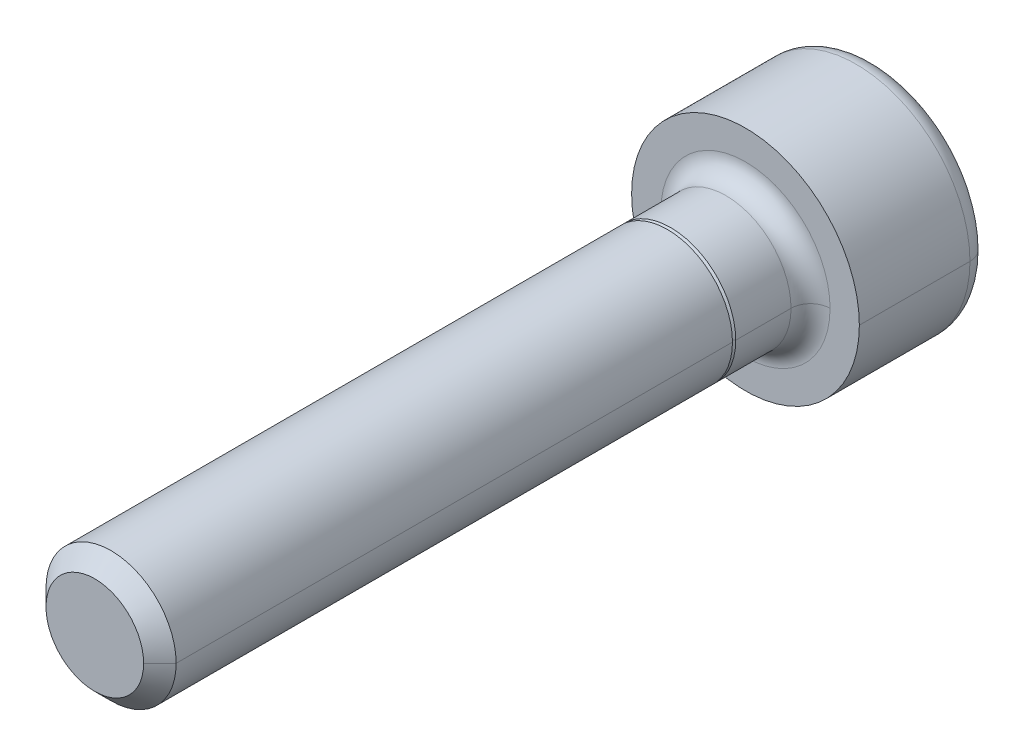
ISO-10303-21;
HEADER;
FILE_DESCRIPTION(('STEP AP214'),'2;1');
FILE_NAME('part.step','',(''),(''),'','','');
FILE_SCHEMA(('AUTOMOTIVE_DESIGN { 1 0 10303 214 1 1 1 1 }'));
ENDSEC;
DATA;
#1=APPLICATION_CONTEXT('core data for automotive mechanical design processes');
#2=APPLICATION_PROTOCOL_DEFINITION('international standard','automotive_design',2000,#1);
#3=PRODUCT_CONTEXT('',#1,'mechanical');
#4=PRODUCT('Part','Part','',(#3));
#5=PRODUCT_RELATED_PRODUCT_CATEGORY('part','',(#4));
#6=PRODUCT_DEFINITION_FORMATION('','',#4);
#7=PRODUCT_DEFINITION_CONTEXT('part definition',#1,'design');
#8=PRODUCT_DEFINITION('design','',#6,#7);
#9=PRODUCT_DEFINITION_SHAPE('','',#8);
#10=(LENGTH_UNIT() NAMED_UNIT(*) SI_UNIT(.MILLI.,.METRE.));
#11=(NAMED_UNIT(*) PLANE_ANGLE_UNIT() SI_UNIT($,.RADIAN.));
#12=(NAMED_UNIT(*) SI_UNIT($,.STERADIAN.) SOLID_ANGLE_UNIT());
#13=UNCERTAINTY_MEASURE_WITH_UNIT(LENGTH_MEASURE(1.E-05),#10,'distance_accuracy_value','');
#14=(GEOMETRIC_REPRESENTATION_CONTEXT(3) GLOBAL_UNCERTAINTY_ASSIGNED_CONTEXT((#13)) GLOBAL_UNIT_ASSIGNED_CONTEXT((#10,
#11,#12)) REPRESENTATION_CONTEXT('',''));
#15=CARTESIAN_POINT('',(0.,0.,0.));
#16=DIRECTION('',(0.,0.,1.));
#17=DIRECTION('',(1.,0.,0.));
#18=AXIS2_PLACEMENT_3D('',#15,#16,#17);
#19=CARTESIAN_POINT('',(0.,0.,-3.4));
#20=DIRECTION('',(0.,0.,1.));
#21=DIRECTION('',(1.,0.,0.));
#22=AXIS2_PLACEMENT_3D('',#19,#20,#21);
#23=TOROIDAL_SURFACE('',#22,2.9,0.6);
#24=CARTESIAN_POINT('',(-2.9,0.,-3.4));
#25=DIRECTION('',(0.,1.,0.));
#26=DIRECTION('',(-1.,0.,0.));
#27=AXIS2_PLACEMENT_3D('',#24,#25,#26);
#28=CIRCLE('',#27,0.6);
#29=CARTESIAN_POINT('',(-2.9,0.,-4.));
#30=VERTEX_POINT('',#29);
#31=CARTESIAN_POINT('',(-3.5,0.,-3.4));
#32=VERTEX_POINT('',#31);
#33=EDGE_CURVE('E348',#30,#32,#28,.T.);
#34=ORIENTED_EDGE('',*,*,#33,.F.);
#35=CARTESIAN_POINT('',(0.,0.,-4.));
#36=DIRECTION('',(0.,0.,-1.));
#37=DIRECTION('',(1.,0.,0.));
#38=AXIS2_PLACEMENT_3D('',#35,#36,#37);
#39=CIRCLE('',#38,2.9);
#40=CARTESIAN_POINT('',(2.9,0.,-4.));
#41=VERTEX_POINT('',#40);
#42=EDGE_CURVE('E243',#41,#30,#39,.T.);
#43=ORIENTED_EDGE('',*,*,#42,.F.);
#44=CARTESIAN_POINT('',(2.9,0.,-3.4));
#45=DIRECTION('',(0.,-1.,0.));
#46=DIRECTION('',(0.,0.,-1.));
#47=AXIS2_PLACEMENT_3D('',#44,#45,#46);
#48=CIRCLE('',#47,0.6);
#49=CARTESIAN_POINT('',(3.5,0.,-3.4));
#50=VERTEX_POINT('',#49);
#51=EDGE_CURVE('E355',#41,#50,#48,.T.);
#52=ORIENTED_EDGE('',*,*,#51,.T.);
#53=CARTESIAN_POINT('',(0.,0.,-3.4));
#54=DIRECTION('',(0.,0.,1.));
#55=DIRECTION('',(1.,0.,0.));
#56=AXIS2_PLACEMENT_3D('',#53,#54,#55);
#57=CIRCLE('',#56,3.5);
#58=EDGE_CURVE('E237',#32,#50,#57,.T.);
#59=ORIENTED_EDGE('',*,*,#58,.F.);
#60=EDGE_LOOP('',(#34,#43,#52,#59));
#61=FACE_BOUND('',#60,.T.);
#62=ADVANCED_FACE('F17',(#61),#23,.T.);
#63=CARTESIAN_POINT('',(0.,0.,0.6));
#64=DIRECTION('',(0.,0.,1.));
#65=DIRECTION('',(1.,0.,0.));
#66=AXIS2_PLACEMENT_3D('',#63,#64,#65);
#67=TOROIDAL_SURFACE('',#66,2.6,0.6);
#68=CARTESIAN_POINT('',(-2.6,0.,0.6));
#69=DIRECTION('',(0.,1.,0.));
#70=DIRECTION('',(-1.,0.,0.));
#71=AXIS2_PLACEMENT_3D('',#68,#69,#70);
#72=CIRCLE('',#71,0.6);
#73=CARTESIAN_POINT('',(-2.,0.,0.6));
#74=VERTEX_POINT('',#73);
#75=CARTESIAN_POINT('',(-2.6,0.,0.));
#76=VERTEX_POINT('',#75);
#77=EDGE_CURVE('E311',#74,#76,#72,.T.);
#78=ORIENTED_EDGE('',*,*,#77,.F.);
#79=CARTESIAN_POINT('',(0.,0.,0.6));
#80=DIRECTION('',(0.,0.,1.));
#81=DIRECTION('',(1.,0.,0.));
#82=AXIS2_PLACEMENT_3D('',#79,#80,#81);
#83=CIRCLE('',#82,2.);
#84=CARTESIAN_POINT('',(2.,0.,0.6));
#85=VERTEX_POINT('',#84);
#86=EDGE_CURVE('E218',#85,#74,#83,.T.);
#87=ORIENTED_EDGE('',*,*,#86,.F.);
#88=CARTESIAN_POINT('',(2.6,0.,0.6));
#89=DIRECTION('',(0.,-1.,0.));
#90=DIRECTION('',(0.,0.,-1.));
#91=AXIS2_PLACEMENT_3D('',#88,#89,#90);
#92=CIRCLE('',#91,0.6);
#93=CARTESIAN_POINT('',(2.6,0.,0.));
#94=VERTEX_POINT('',#93);
#95=EDGE_CURVE('E318',#85,#94,#92,.T.);
#96=ORIENTED_EDGE('',*,*,#95,.T.);
#97=CARTESIAN_POINT('',(0.,0.,0.));
#98=DIRECTION('',(0.,0.,-1.));
#99=DIRECTION('',(1.,0.,0.));
#100=AXIS2_PLACEMENT_3D('',#97,#98,#99);
#101=CIRCLE('',#100,2.6);
#102=EDGE_CURVE('E277',#76,#94,#101,.T.);
#103=ORIENTED_EDGE('',*,*,#102,.F.);
#104=EDGE_LOOP('',(#78,#87,#96,#103));
#105=FACE_BOUND('',#104,.T.);
#106=ADVANCED_FACE('F384',(#105),#67,.F.);
#107=CARTESIAN_POINT('',(0.,0.,20.));
#108=DIRECTION('',(0.,0.,-1.));
#109=DIRECTION('',(-1.,0.,0.));
#110=AXIS2_PLACEMENT_3D('',#107,#108,#109);
#111=CONICAL_SURFACE('',#110,1.5,0.785398163397443);
#112=DIRECTION('',(0.707106781186544,0.,-0.707106781186551));
#113=VECTOR('',#112,1.);
#114=CARTESIAN_POINT('',(1.5,0.,20.));
#115=LINE('',#114,#113);
#116=CARTESIAN_POINT('',(1.5,0.,20.));
#117=VERTEX_POINT('',#116);
#118=CARTESIAN_POINT('',(2.,0.,19.5));
#119=VERTEX_POINT('',#118);
#120=EDGE_CURVE('E337',#117,#119,#115,.T.);
#121=ORIENTED_EDGE('',*,*,#120,.F.);
#122=CARTESIAN_POINT('',(0.,0.,20.));
#123=DIRECTION('',(0.,0.,1.));
#124=DIRECTION('',(1.,0.,0.));
#125=AXIS2_PLACEMENT_3D('',#122,#123,#124);
#126=CIRCLE('',#125,1.5);
#127=CARTESIAN_POINT('',(-1.5,0.,20.));
#128=VERTEX_POINT('',#127);
#129=EDGE_CURVE('E11',#128,#117,#126,.T.);
#130=ORIENTED_EDGE('',*,*,#129,.F.);
#131=DIRECTION('',(-0.707106781186544,0.,-0.707106781186551));
#132=VECTOR('',#131,1.);
#133=CARTESIAN_POINT('',(-1.5,0.,20.));
#134=LINE('',#133,#132);
#135=CARTESIAN_POINT('',(-2.,0.,19.5));
#136=VERTEX_POINT('',#135);
#137=EDGE_CURVE('E323',#128,#136,#134,.T.);
#138=ORIENTED_EDGE('',*,*,#137,.T.);
#139=CARTESIAN_POINT('',(0.,0.,19.5));
#140=DIRECTION('',(0.,0.,-1.));
#141=DIRECTION('',(1.,0.,0.));
#142=AXIS2_PLACEMENT_3D('',#139,#140,#141);
#143=CIRCLE('',#142,2.);
#144=EDGE_CURVE('E180',#119,#136,#143,.T.);
#145=ORIENTED_EDGE('',*,*,#144,.F.);
#146=EDGE_LOOP('',(#121,#130,#138,#145));
#147=FACE_BOUND('',#146,.T.);
#148=ADVANCED_FACE('F864',(#147),#111,.T.);
#149=CARTESIAN_POINT('',(0.,0.,2.4));
#150=DIRECTION('',(0.,0.,1.));
#151=DIRECTION('',(1.,0.,0.));
#152=AXIS2_PLACEMENT_3D('',#149,#150,#151);
#153=PLANE('',#152);
#154=CARTESIAN_POINT('',(0.,0.,2.4));
#155=DIRECTION('',(0.,0.,1.));
#156=DIRECTION('',(1.,0.,0.));
#157=AXIS2_PLACEMENT_3D('',#154,#155,#156);
#158=CIRCLE('',#157,1.9);
#159=CARTESIAN_POINT('',(-1.9,0.,2.4));
#160=VERTEX_POINT('',#159);
#161=CARTESIAN_POINT('',(1.9,0.,2.4));
#162=VERTEX_POINT('',#161);
#163=EDGE_CURVE('E169',#160,#162,#158,.T.);
#164=ORIENTED_EDGE('',*,*,#163,.T.);
#165=CARTESIAN_POINT('',(0.,0.,2.4));
#166=DIRECTION('',(0.,0.,1.));
#167=DIRECTION('',(1.,0.,0.));
#168=AXIS2_PLACEMENT_3D('',#165,#166,#167);
#169=CIRCLE('',#168,1.9);
#170=EDGE_CURVE('E185',#162,#160,#169,.T.);
#171=ORIENTED_EDGE('',*,*,#170,.T.);
#172=EDGE_LOOP('',(#164,#171));
#173=FACE_BOUND('',#172,.T.);
#174=CARTESIAN_POINT('',(0.,0.,2.4));
#175=DIRECTION('',(0.,0.,1.));
#176=DIRECTION('',(1.,0.,0.));
#177=AXIS2_PLACEMENT_3D('',#174,#175,#176);
#178=CIRCLE('',#177,2.);
#179=CARTESIAN_POINT('',(-2.,0.,2.4));
#180=VERTEX_POINT('',#179);
#181=CARTESIAN_POINT('',(2.,0.,2.4));
#182=VERTEX_POINT('',#181);
#183=EDGE_CURVE('E25',#180,#182,#178,.T.);
#184=ORIENTED_EDGE('',*,*,#183,.F.);
#185=CARTESIAN_POINT('',(0.,0.,2.4));
#186=DIRECTION('',(0.,0.,1.));
#187=DIRECTION('',(1.,0.,0.));
#188=AXIS2_PLACEMENT_3D('',#185,#186,#187);
#189=CIRCLE('',#188,2.);
#190=EDGE_CURVE('E203',#182,#180,#189,.T.);
#191=ORIENTED_EDGE('',*,*,#190,.F.);
#192=EDGE_LOOP('',(#184,#191));
#193=FACE_BOUND('',#192,.T.);
#194=ADVANCED_FACE('F191',(#173,#193),#153,.F.);
#195=CARTESIAN_POINT('',(0.,0.,20.));
#196=DIRECTION('',(0.,0.,1.));
#197=DIRECTION('',(1.,0.,0.));
#198=AXIS2_PLACEMENT_3D('',#195,#196,#197);
#199=PLANE('',#198);
#200=ORIENTED_EDGE('',*,*,#129,.T.);
#201=CARTESIAN_POINT('',(0.,0.,20.));
#202=DIRECTION('',(0.,0.,1.));
#203=DIRECTION('',(1.,0.,0.));
#204=AXIS2_PLACEMENT_3D('',#201,#202,#203);
#205=CIRCLE('',#204,1.5);
#206=EDGE_CURVE('E321',#117,#128,#205,.T.);
#207=ORIENTED_EDGE('',*,*,#206,.T.);
#208=EDGE_LOOP('',(#200,#207));
#209=FACE_BOUND('',#208,.T.);
#210=ADVANCED_FACE('F844',(#209),#199,.T.);
#211=CARTESIAN_POINT('',(0.,0.,20.));
#212=DIRECTION('',(0.,0.,-1.));
#213=DIRECTION('',(-1.,0.,0.));
#214=AXIS2_PLACEMENT_3D('',#211,#212,#213);
#215=CYLINDRICAL_SURFACE('',#214,2.);
#216=DIRECTION('',(0.,0.,-1.));
#217=VECTOR('',#216,1.);
#218=CARTESIAN_POINT('',(2.,0.,20.));
#219=LINE('',#218,#217);
#220=EDGE_CURVE('E326',#119,#182,#219,.T.);
#221=ORIENTED_EDGE('',*,*,#220,.F.);
#222=ORIENTED_EDGE('',*,*,#144,.T.);
#223=DIRECTION('',(0.,0.,-1.));
#224=VECTOR('',#223,1.);
#225=CARTESIAN_POINT('',(-2.,0.,20.));
#226=LINE('',#225,#224);
#227=EDGE_CURVE('E194',#136,#180,#226,.T.);
#228=ORIENTED_EDGE('',*,*,#227,.T.);
#229=ORIENTED_EDGE('',*,*,#183,.T.);
#230=EDGE_LOOP('',(#221,#222,#228,#229));
#231=FACE_BOUND('',#230,.T.);
#232=ADVANCED_FACE('F834',(#231),#215,.T.);
#233=CARTESIAN_POINT('',(0.,0.,2.4));
#234=DIRECTION('',(0.,0.,-1.));
#235=DIRECTION('',(-1.,0.,0.));
#236=AXIS2_PLACEMENT_3D('',#233,#234,#235);
#237=CONICAL_SURFACE('',#236,1.9,0.785398163397448);
#238=DIRECTION('',(0.707106781186548,0.,-0.707106781186548));
#239=VECTOR('',#238,1.);
#240=CARTESIAN_POINT('',(1.9,0.,2.4));
#241=LINE('',#240,#239);
#242=CARTESIAN_POINT('',(2.,0.,2.3));
#243=VERTEX_POINT('',#242);
#244=EDGE_CURVE('E175',#162,#243,#241,.T.);
#245=ORIENTED_EDGE('',*,*,#244,.F.);
#246=ORIENTED_EDGE('',*,*,#163,.F.);
#247=DIRECTION('',(-0.707106781186548,0.,-0.707106781186548));
#248=VECTOR('',#247,1.);
#249=CARTESIAN_POINT('',(-1.9,0.,2.4));
#250=LINE('',#249,#248);
#251=CARTESIAN_POINT('',(-2.,0.,2.3));
#252=VERTEX_POINT('',#251);
#253=EDGE_CURVE('E172',#160,#252,#250,.T.);
#254=ORIENTED_EDGE('',*,*,#253,.T.);
#255=CARTESIAN_POINT('',(0.,0.,2.3));
#256=DIRECTION('',(0.,0.,-1.));
#257=DIRECTION('',(1.,0.,0.));
#258=AXIS2_PLACEMENT_3D('',#255,#256,#257);
#259=CIRCLE('',#258,2.);
#260=EDGE_CURVE('E181',#243,#252,#259,.T.);
#261=ORIENTED_EDGE('',*,*,#260,.F.);
#262=EDGE_LOOP('',(#245,#246,#254,#261));
#263=FACE_BOUND('',#262,.T.);
#264=ADVANCED_FACE('F171',(#263),#237,.T.);
#265=CARTESIAN_POINT('',(0.,0.,2.4));
#266=DIRECTION('',(0.,0.,-1.));
#267=DIRECTION('',(-1.,0.,0.));
#268=AXIS2_PLACEMENT_3D('',#265,#266,#267);
#269=CYLINDRICAL_SURFACE('',#268,2.);
#270=DIRECTION('',(0.,0.,-1.));
#271=VECTOR('',#270,1.);
#272=CARTESIAN_POINT('',(2.,0.,2.4));
#273=LINE('',#272,#271);
#274=EDGE_CURVE('E189',#243,#85,#273,.T.);
#275=ORIENTED_EDGE('',*,*,#274,.F.);
#276=ORIENTED_EDGE('',*,*,#260,.T.);
#277=DIRECTION('',(0.,0.,-1.));
#278=VECTOR('',#277,1.);
#279=CARTESIAN_POINT('',(-2.,0.,2.4));
#280=LINE('',#279,#278);
#281=EDGE_CURVE('E222',#252,#74,#280,.T.);
#282=ORIENTED_EDGE('',*,*,#281,.T.);
#283=CARTESIAN_POINT('',(0.,0.,0.6));
#284=DIRECTION('',(0.,0.,1.));
#285=DIRECTION('',(1.,0.,0.));
#286=AXIS2_PLACEMENT_3D('',#283,#284,#285);
#287=CIRCLE('',#286,2.);
#288=EDGE_CURVE('E363',#74,#85,#287,.T.);
#289=ORIENTED_EDGE('',*,*,#288,.T.);
#290=EDGE_LOOP('',(#275,#276,#282,#289));
#291=FACE_BOUND('',#290,.T.);
#292=ADVANCED_FACE('F815',(#291),#269,.T.);
#293=CARTESIAN_POINT('',(0.,0.,-1.5));
#294=DIRECTION('',(0.,0.,-1.));
#295=DIRECTION('',(0.,-1.,0.));
#296=AXIS2_PLACEMENT_3D('',#293,#294,#295);
#297=PLANE('',#296);
#298=DIRECTION('',(-0.5,-0.866025403784439,0.));
#299=VECTOR('',#298,1.);
#300=CARTESIAN_POINT('',(1.73205080756888,0.,-1.5));
#301=LINE('',#300,#299);
#302=CARTESIAN_POINT('',(1.73205080756888,0.,-1.5));
#303=VERTEX_POINT('',#302);
#304=CARTESIAN_POINT('',(0.866025403784438,-1.5,-1.5));
#305=VERTEX_POINT('',#304);
#306=EDGE_CURVE('E211',#303,#305,#301,.T.);
#307=ORIENTED_EDGE('',*,*,#306,.T.);
#308=DIRECTION('',(-1.,0.,0.));
#309=VECTOR('',#308,1.);
#310=CARTESIAN_POINT('',(0.866025403784438,-1.5,-1.5));
#311=LINE('',#310,#309);
#312=CARTESIAN_POINT('',(-0.866025403784439,-1.5,-1.5));
#313=VERTEX_POINT('',#312);
#314=EDGE_CURVE('E38',#305,#313,#311,.T.);
#315=ORIENTED_EDGE('',*,*,#314,.T.);
#316=DIRECTION('',(-0.5,0.866025403784439,0.));
#317=VECTOR('',#316,1.);
#318=CARTESIAN_POINT('',(-0.866025403784439,-1.5,-1.5));
#319=LINE('',#318,#317);
#320=CARTESIAN_POINT('',(-1.73205080756888,0.,-1.5));
#321=VERTEX_POINT('',#320);
#322=EDGE_CURVE('E46',#313,#321,#319,.T.);
#323=ORIENTED_EDGE('',*,*,#322,.T.);
#324=DIRECTION('',(0.5,0.866025403784439,0.));
#325=VECTOR('',#324,1.);
#326=CARTESIAN_POINT('',(-1.73205080756888,0.,-1.5));
#327=LINE('',#326,#325);
#328=CARTESIAN_POINT('',(-0.866025403784439,1.5,-1.5));
#329=VERTEX_POINT('',#328);
#330=EDGE_CURVE('E289',#321,#329,#327,.T.);
#331=ORIENTED_EDGE('',*,*,#330,.T.);
#332=DIRECTION('',(1.,0.,0.));
#333=VECTOR('',#332,1.);
#334=CARTESIAN_POINT('',(-0.866025403784439,1.5,-1.5));
#335=LINE('',#334,#333);
#336=CARTESIAN_POINT('',(0.86602540378444,1.5,-1.5));
#337=VERTEX_POINT('',#336);
#338=EDGE_CURVE('E269',#329,#337,#335,.T.);
#339=ORIENTED_EDGE('',*,*,#338,.T.);
#340=DIRECTION('',(0.5,-0.866025403784439,0.));
#341=VECTOR('',#340,1.);
#342=CARTESIAN_POINT('',(0.86602540378444,1.5,-1.5));
#343=LINE('',#342,#341);
#344=EDGE_CURVE('E210',#337,#303,#343,.T.);
#345=ORIENTED_EDGE('',*,*,#344,.T.);
#346=EDGE_LOOP('',(#307,#315,#323,#331,#339,#345));
#347=FACE_BOUND('',#346,.T.);
#348=ADVANCED_FACE('F804',(#347),#297,.T.);
#349=CARTESIAN_POINT('',(0.866025403784438,-1.5,-1.5));
#350=DIRECTION('',(0.,-1.,0.));
#351=DIRECTION('',(-1.,0.,0.));
#352=AXIS2_PLACEMENT_3D('',#349,#350,#351);
#353=PLANE('',#352);
#354=DIRECTION('',(-1.,0.,0.));
#355=VECTOR('',#354,1.);
#356=CARTESIAN_POINT('',(0.866025403784438,-1.5,-4.));
#357=LINE('',#356,#355);
#358=CARTESIAN_POINT('',(0.866025403784438,-1.5,-4.));
#359=VERTEX_POINT('',#358);
#360=CARTESIAN_POINT('',(-0.866025403784439,-1.5,-4.));
#361=VERTEX_POINT('',#360);
#362=EDGE_CURVE('E246',#359,#361,#357,.T.);
#363=ORIENTED_EDGE('',*,*,#362,.T.);
#364=DIRECTION('',(0.,0.,-1.));
#365=VECTOR('',#364,1.);
#366=CARTESIAN_POINT('',(-0.866025403784439,-1.5,-1.5));
#367=LINE('',#366,#365);
#368=EDGE_CURVE('E225',#313,#361,#367,.T.);
#369=ORIENTED_EDGE('',*,*,#368,.F.);
#370=ORIENTED_EDGE('',*,*,#314,.F.);
#371=DIRECTION('',(0.,0.,-1.));
#372=VECTOR('',#371,1.);
#373=CARTESIAN_POINT('',(0.866025403784438,-1.5,-1.5));
#374=LINE('',#373,#372);
#375=EDGE_CURVE('E249',#305,#359,#374,.T.);
#376=ORIENTED_EDGE('',*,*,#375,.T.);
#377=EDGE_LOOP('',(#363,#369,#370,#376));
#378=FACE_BOUND('',#377,.T.);
#379=ADVANCED_FACE('F766',(#378),#353,.F.);
#380=CARTESIAN_POINT('',(-0.866025403784439,-1.5,-1.5));
#381=DIRECTION('',(-0.866025403784439,-0.5,0.));
#382=DIRECTION('',(-0.5,0.866025403784439,0.));
#383=AXIS2_PLACEMENT_3D('',#380,#381,#382);
#384=PLANE('',#383);
#385=DIRECTION('',(-0.5,0.866025403784439,0.));
#386=VECTOR('',#385,1.);
#387=CARTESIAN_POINT('',(-0.866025403784439,-1.5,-4.));
#388=LINE('',#387,#386);
#389=CARTESIAN_POINT('',(-1.73205080756888,0.,-4.));
#390=VERTEX_POINT('',#389);
#391=EDGE_CURVE('E273',#361,#390,#388,.T.);
#392=ORIENTED_EDGE('',*,*,#391,.T.);
#393=DIRECTION('',(0.,0.,-1.));
#394=VECTOR('',#393,1.);
#395=CARTESIAN_POINT('',(-1.73205080756888,0.,-1.5));
#396=LINE('',#395,#394);
#397=EDGE_CURVE('E292',#321,#390,#396,.T.);
#398=ORIENTED_EDGE('',*,*,#397,.F.);
#399=ORIENTED_EDGE('',*,*,#322,.F.);
#400=ORIENTED_EDGE('',*,*,#368,.T.);
#401=EDGE_LOOP('',(#392,#398,#399,#400));
#402=FACE_BOUND('',#401,.T.);
#403=ADVANCED_FACE('F700',(#402),#384,.F.);
#404=CARTESIAN_POINT('',(-1.73205080756888,0.,-1.5));
#405=DIRECTION('',(-0.866025403784439,0.5,0.));
#406=DIRECTION('',(0.,0.,1.));
#407=AXIS2_PLACEMENT_3D('',#404,#405,#406);
#408=PLANE('',#407);
#409=DIRECTION('',(0.5,0.866025403784439,0.));
#410=VECTOR('',#409,1.);
#411=CARTESIAN_POINT('',(-1.73205080756888,0.,-4.));
#412=LINE('',#411,#410);
#413=CARTESIAN_POINT('',(-0.866025403784439,1.5,-4.));
#414=VERTEX_POINT('',#413);
#415=EDGE_CURVE('E265',#390,#414,#412,.T.);
#416=ORIENTED_EDGE('',*,*,#415,.T.);
#417=DIRECTION('',(0.,0.,-1.));
#418=VECTOR('',#417,1.);
#419=CARTESIAN_POINT('',(-0.866025403784439,1.5,-1.5));
#420=LINE('',#419,#418);
#421=EDGE_CURVE('E286',#329,#414,#420,.T.);
#422=ORIENTED_EDGE('',*,*,#421,.F.);
#423=ORIENTED_EDGE('',*,*,#330,.F.);
#424=ORIENTED_EDGE('',*,*,#397,.T.);
#425=EDGE_LOOP('',(#416,#422,#423,#424));
#426=FACE_BOUND('',#425,.T.);
#427=ADVANCED_FACE('F658',(#426),#408,.F.);
#428=CARTESIAN_POINT('',(-0.866025403784439,1.5,-1.5));
#429=DIRECTION('',(0.,1.,0.));
#430=DIRECTION('',(1.,0.,0.));
#431=AXIS2_PLACEMENT_3D('',#428,#429,#430);
#432=PLANE('',#431);
#433=DIRECTION('',(1.,0.,0.));
#434=VECTOR('',#433,1.);
#435=CARTESIAN_POINT('',(-0.866025403784439,1.5,-4.));
#436=LINE('',#435,#434);
#437=CARTESIAN_POINT('',(0.86602540378444,1.5,-4.));
#438=VERTEX_POINT('',#437);
#439=EDGE_CURVE('E261',#414,#438,#436,.T.);
#440=ORIENTED_EDGE('',*,*,#439,.T.);
#441=DIRECTION('',(0.,0.,-1.));
#442=VECTOR('',#441,1.);
#443=CARTESIAN_POINT('',(0.86602540378444,1.5,-1.5));
#444=LINE('',#443,#442);
#445=EDGE_CURVE('E266',#337,#438,#444,.T.);
#446=ORIENTED_EDGE('',*,*,#445,.F.);
#447=ORIENTED_EDGE('',*,*,#338,.F.);
#448=ORIENTED_EDGE('',*,*,#421,.T.);
#449=EDGE_LOOP('',(#440,#446,#447,#448));
#450=FACE_BOUND('',#449,.T.);
#451=ADVANCED_FACE('F652',(#450),#432,.F.);
#452=CARTESIAN_POINT('',(0.86602540378444,1.5,-1.5));
#453=DIRECTION('',(0.866025403784439,0.5,0.));
#454=DIRECTION('',(0.,0.,-1.));
#455=AXIS2_PLACEMENT_3D('',#452,#453,#454);
#456=PLANE('',#455);
#457=DIRECTION('',(0.5,-0.866025403784439,0.));
#458=VECTOR('',#457,1.);
#459=CARTESIAN_POINT('',(0.86602540378444,1.5,-4.));
#460=LINE('',#459,#458);
#461=CARTESIAN_POINT('',(1.73205080756888,0.,-4.));
#462=VERTEX_POINT('',#461);
#463=EDGE_CURVE('E256',#438,#462,#460,.T.);
#464=ORIENTED_EDGE('',*,*,#463,.T.);
#465=DIRECTION('',(0.,0.,-1.));
#466=VECTOR('',#465,1.);
#467=CARTESIAN_POINT('',(1.73205080756888,0.,-1.5));
#468=LINE('',#467,#466);
#469=EDGE_CURVE('E208',#303,#462,#468,.T.);
#470=ORIENTED_EDGE('',*,*,#469,.F.);
#471=ORIENTED_EDGE('',*,*,#344,.F.);
#472=ORIENTED_EDGE('',*,*,#445,.T.);
#473=EDGE_LOOP('',(#464,#470,#471,#472));
#474=FACE_BOUND('',#473,.T.);
#475=ADVANCED_FACE('F657',(#474),#456,.F.);
#476=CARTESIAN_POINT('',(1.73205080756888,0.,-1.5));
#477=DIRECTION('',(0.866025403784439,-0.5,0.));
#478=DIRECTION('',(0.,0.,-1.));
#479=AXIS2_PLACEMENT_3D('',#476,#477,#478);
#480=PLANE('',#479);
#481=DIRECTION('',(-0.5,-0.866025403784439,0.));
#482=VECTOR('',#481,1.);
#483=CARTESIAN_POINT('',(1.73205080756888,0.,-4.));
#484=LINE('',#483,#482);
#485=EDGE_CURVE('E253',#462,#359,#484,.T.);
#486=ORIENTED_EDGE('',*,*,#485,.T.);
#487=ORIENTED_EDGE('',*,*,#375,.F.);
#488=ORIENTED_EDGE('',*,*,#306,.F.);
#489=ORIENTED_EDGE('',*,*,#469,.T.);
#490=EDGE_LOOP('',(#486,#487,#488,#489));
#491=FACE_BOUND('',#490,.T.);
#492=ADVANCED_FACE('F390',(#491),#480,.F.);
#493=CARTESIAN_POINT('',(0.,0.,0.));
#494=DIRECTION('',(0.,0.,1.));
#495=DIRECTION('',(1.,0.,0.));
#496=AXIS2_PLACEMENT_3D('',#493,#494,#495);
#497=PLANE('',#496);
#498=CARTESIAN_POINT('',(0.,0.,0.));
#499=DIRECTION('',(0.,0.,-1.));
#500=DIRECTION('',(1.,0.,0.));
#501=AXIS2_PLACEMENT_3D('',#498,#499,#500);
#502=CIRCLE('',#501,2.6);
#503=EDGE_CURVE('E322',#94,#76,#502,.T.);
#504=ORIENTED_EDGE('',*,*,#503,.T.);
#505=ORIENTED_EDGE('',*,*,#102,.T.);
#506=EDGE_LOOP('',(#504,#505));
#507=FACE_BOUND('',#506,.T.);
#508=CARTESIAN_POINT('',(0.,0.,0.));
#509=DIRECTION('',(0.,0.,1.));
#510=DIRECTION('',(1.,0.,0.));
#511=AXIS2_PLACEMENT_3D('',#508,#509,#510);
#512=CIRCLE('',#511,3.5);
#513=CARTESIAN_POINT('',(3.5,0.,0.));
#514=VERTEX_POINT('',#513);
#515=CARTESIAN_POINT('',(-3.5,0.,0.));
#516=VERTEX_POINT('',#515);
#517=EDGE_CURVE('E229',#514,#516,#512,.T.);
#518=ORIENTED_EDGE('',*,*,#517,.T.);
#519=CARTESIAN_POINT('',(0.,0.,0.));
#520=DIRECTION('',(0.,0.,1.));
#521=DIRECTION('',(1.,0.,0.));
#522=AXIS2_PLACEMENT_3D('',#519,#520,#521);
#523=CIRCLE('',#522,3.5);
#524=EDGE_CURVE('E240',#516,#514,#523,.T.);
#525=ORIENTED_EDGE('',*,*,#524,.T.);
#526=EDGE_LOOP('',(#518,#525));
#527=FACE_BOUND('',#526,.T.);
#528=ADVANCED_FACE('F386',(#507,#527),#497,.T.);
#529=CARTESIAN_POINT('',(0.,0.,-4.));
#530=DIRECTION('',(0.,0.,1.));
#531=DIRECTION('',(1.,0.,0.));
#532=AXIS2_PLACEMENT_3D('',#529,#530,#531);
#533=PLANE('',#532);
#534=ORIENTED_EDGE('',*,*,#362,.F.);
#535=ORIENTED_EDGE('',*,*,#485,.F.);
#536=ORIENTED_EDGE('',*,*,#463,.F.);
#537=ORIENTED_EDGE('',*,*,#439,.F.);
#538=ORIENTED_EDGE('',*,*,#415,.F.);
#539=ORIENTED_EDGE('',*,*,#391,.F.);
#540=EDGE_LOOP('',(#534,#535,#536,#537,#538,#539));
#541=FACE_BOUND('',#540,.T.);
#542=ORIENTED_EDGE('',*,*,#42,.T.);
#543=CARTESIAN_POINT('',(0.,0.,-4.));
#544=DIRECTION('',(0.,0.,-1.));
#545=DIRECTION('',(1.,0.,0.));
#546=AXIS2_PLACEMENT_3D('',#543,#544,#545);
#547=CIRCLE('',#546,2.9);
#548=EDGE_CURVE('E347',#30,#41,#547,.T.);
#549=ORIENTED_EDGE('',*,*,#548,.T.);
#550=EDGE_LOOP('',(#542,#549));
#551=FACE_BOUND('',#550,.T.);
#552=ADVANCED_FACE('F389',(#541,#551),#533,.F.);
#553=CARTESIAN_POINT('',(0.,0.,-4.));
#554=DIRECTION('',(0.,0.,1.));
#555=DIRECTION('',(1.,0.,0.));
#556=AXIS2_PLACEMENT_3D('',#553,#554,#555);
#557=CYLINDRICAL_SURFACE('',#556,3.5);
#558=DIRECTION('',(0.,0.,1.));
#559=VECTOR('',#558,1.);
#560=CARTESIAN_POINT('',(-3.5,0.,-4.));
#561=LINE('',#560,#559);
#562=EDGE_CURVE('E228',#32,#516,#561,.T.);
#563=ORIENTED_EDGE('',*,*,#562,.F.);
#564=ORIENTED_EDGE('',*,*,#58,.T.);
#565=DIRECTION('',(0.,0.,1.));
#566=VECTOR('',#565,1.);
#567=CARTESIAN_POINT('',(3.5,0.,-4.));
#568=LINE('',#567,#566);
#569=EDGE_CURVE('E233',#50,#514,#568,.T.);
#570=ORIENTED_EDGE('',*,*,#569,.T.);
#571=ORIENTED_EDGE('',*,*,#524,.F.);
#572=EDGE_LOOP('',(#563,#564,#570,#571));
#573=FACE_BOUND('',#572,.T.);
#574=ADVANCED_FACE('F399',(#573),#557,.T.);
#575=CARTESIAN_POINT('',(0.,0.,-4.));
#576=DIRECTION('',(0.,0.,1.));
#577=DIRECTION('',(1.,0.,0.));
#578=AXIS2_PLACEMENT_3D('',#575,#576,#577);
#579=CYLINDRICAL_SURFACE('',#578,3.5);
#580=CARTESIAN_POINT('',(0.,0.,-3.4));
#581=DIRECTION('',(0.,0.,1.));
#582=DIRECTION('',(1.,0.,0.));
#583=AXIS2_PLACEMENT_3D('',#580,#581,#582);
#584=CIRCLE('',#583,3.5);
#585=EDGE_CURVE('E352',#50,#32,#584,.T.);
#586=ORIENTED_EDGE('',*,*,#585,.T.);
#587=ORIENTED_EDGE('',*,*,#562,.T.);
#588=ORIENTED_EDGE('',*,*,#517,.F.);
#589=ORIENTED_EDGE('',*,*,#569,.F.);
#590=EDGE_LOOP('',(#586,#587,#588,#589));
#591=FACE_BOUND('',#590,.T.);
#592=ADVANCED_FACE('F396',(#591),#579,.T.);
#593=CARTESIAN_POINT('',(0.,0.,2.4));
#594=DIRECTION('',(0.,0.,-1.));
#595=DIRECTION('',(-1.,0.,0.));
#596=AXIS2_PLACEMENT_3D('',#593,#594,#595);
#597=CYLINDRICAL_SURFACE('',#596,2.);
#598=CARTESIAN_POINT('',(0.,0.,2.3));
#599=DIRECTION('',(0.,0.,-1.));
#600=DIRECTION('',(1.,0.,0.));
#601=AXIS2_PLACEMENT_3D('',#598,#599,#600);
#602=CIRCLE('',#601,2.);
#603=EDGE_CURVE('E187',#252,#243,#602,.T.);
#604=ORIENTED_EDGE('',*,*,#603,.T.);
#605=ORIENTED_EDGE('',*,*,#274,.T.);
#606=ORIENTED_EDGE('',*,*,#86,.T.);
#607=ORIENTED_EDGE('',*,*,#281,.F.);
#608=EDGE_LOOP('',(#604,#605,#606,#607));
#609=FACE_BOUND('',#608,.T.);
#610=ADVANCED_FACE('F720',(#609),#597,.T.);
#611=CARTESIAN_POINT('',(0.,0.,2.4));
#612=DIRECTION('',(0.,0.,-1.));
#613=DIRECTION('',(-1.,0.,0.));
#614=AXIS2_PLACEMENT_3D('',#611,#612,#613);
#615=CONICAL_SURFACE('',#614,1.9,0.785398163397448);
#616=ORIENTED_EDGE('',*,*,#170,.F.);
#617=ORIENTED_EDGE('',*,*,#244,.T.);
#618=ORIENTED_EDGE('',*,*,#603,.F.);
#619=ORIENTED_EDGE('',*,*,#253,.F.);
#620=EDGE_LOOP('',(#616,#617,#618,#619));
#621=FACE_BOUND('',#620,.T.);
#622=ADVANCED_FACE('F184',(#621),#615,.T.);
#623=CARTESIAN_POINT('',(0.,0.,20.));
#624=DIRECTION('',(0.,0.,-1.));
#625=DIRECTION('',(-1.,0.,0.));
#626=AXIS2_PLACEMENT_3D('',#623,#624,#625);
#627=CYLINDRICAL_SURFACE('',#626,2.);
#628=CARTESIAN_POINT('',(0.,0.,19.5));
#629=DIRECTION('',(0.,0.,-1.));
#630=DIRECTION('',(1.,0.,0.));
#631=AXIS2_PLACEMENT_3D('',#628,#629,#630);
#632=CIRCLE('',#631,2.);
#633=EDGE_CURVE('E327',#136,#119,#632,.T.);
#634=ORIENTED_EDGE('',*,*,#633,.T.);
#635=ORIENTED_EDGE('',*,*,#220,.T.);
#636=ORIENTED_EDGE('',*,*,#190,.T.);
#637=ORIENTED_EDGE('',*,*,#227,.F.);
#638=EDGE_LOOP('',(#634,#635,#636,#637));
#639=FACE_BOUND('',#638,.T.);
#640=ADVANCED_FACE('F681',(#639),#627,.T.);
#641=CARTESIAN_POINT('',(0.,0.,20.));
#642=DIRECTION('',(0.,0.,-1.));
#643=DIRECTION('',(-1.,0.,0.));
#644=AXIS2_PLACEMENT_3D('',#641,#642,#643);
#645=CONICAL_SURFACE('',#644,1.5,0.785398163397443);
#646=ORIENTED_EDGE('',*,*,#206,.F.);
#647=ORIENTED_EDGE('',*,*,#120,.T.);
#648=ORIENTED_EDGE('',*,*,#633,.F.);
#649=ORIENTED_EDGE('',*,*,#137,.F.);
#650=EDGE_LOOP('',(#646,#647,#648,#649));
#651=FACE_BOUND('',#650,.T.);
#652=ADVANCED_FACE('F676',(#651),#645,.T.);
#653=CARTESIAN_POINT('',(0.,0.,0.6));
#654=DIRECTION('',(0.,0.,1.));
#655=DIRECTION('',(1.,0.,0.));
#656=AXIS2_PLACEMENT_3D('',#653,#654,#655);
#657=TOROIDAL_SURFACE('',#656,2.6,0.6);
#658=ORIENTED_EDGE('',*,*,#288,.F.);
#659=ORIENTED_EDGE('',*,*,#77,.T.);
#660=ORIENTED_EDGE('',*,*,#503,.F.);
#661=ORIENTED_EDGE('',*,*,#95,.F.);
#662=EDGE_LOOP('',(#658,#659,#660,#661));
#663=FACE_BOUND('',#662,.T.);
#664=ADVANCED_FACE('F381',(#663),#657,.F.);
#665=CARTESIAN_POINT('',(0.,0.,-3.4));
#666=DIRECTION('',(0.,0.,1.));
#667=DIRECTION('',(1.,0.,0.));
#668=AXIS2_PLACEMENT_3D('',#665,#666,#667);
#669=TOROIDAL_SURFACE('',#668,2.9,0.6);
#670=ORIENTED_EDGE('',*,*,#548,.F.);
#671=ORIENTED_EDGE('',*,*,#33,.T.);
#672=ORIENTED_EDGE('',*,*,#585,.F.);
#673=ORIENTED_EDGE('',*,*,#51,.F.);
#674=EDGE_LOOP('',(#670,#671,#672,#673));
#675=FACE_BOUND('',#674,.T.);
#676=ADVANCED_FACE('F406',(#675),#669,.T.);
#677=CLOSED_SHELL('',(#62,#106,#148,#194,#210,#232,#264,#292,#348,#379,#403,#427,#451,#475,#492,
#528,#552,#574,#592,#610,#622,#640,#652,#664,#676));
#678=MANIFOLD_SOLID_BREP('B1',#677);
#679=ADVANCED_BREP_SHAPE_REPRESENTATION('',(#18,#678),#14);
#680=SHAPE_DEFINITION_REPRESENTATION(#9,#679);
ENDSEC;
END-ISO-10303-21;
